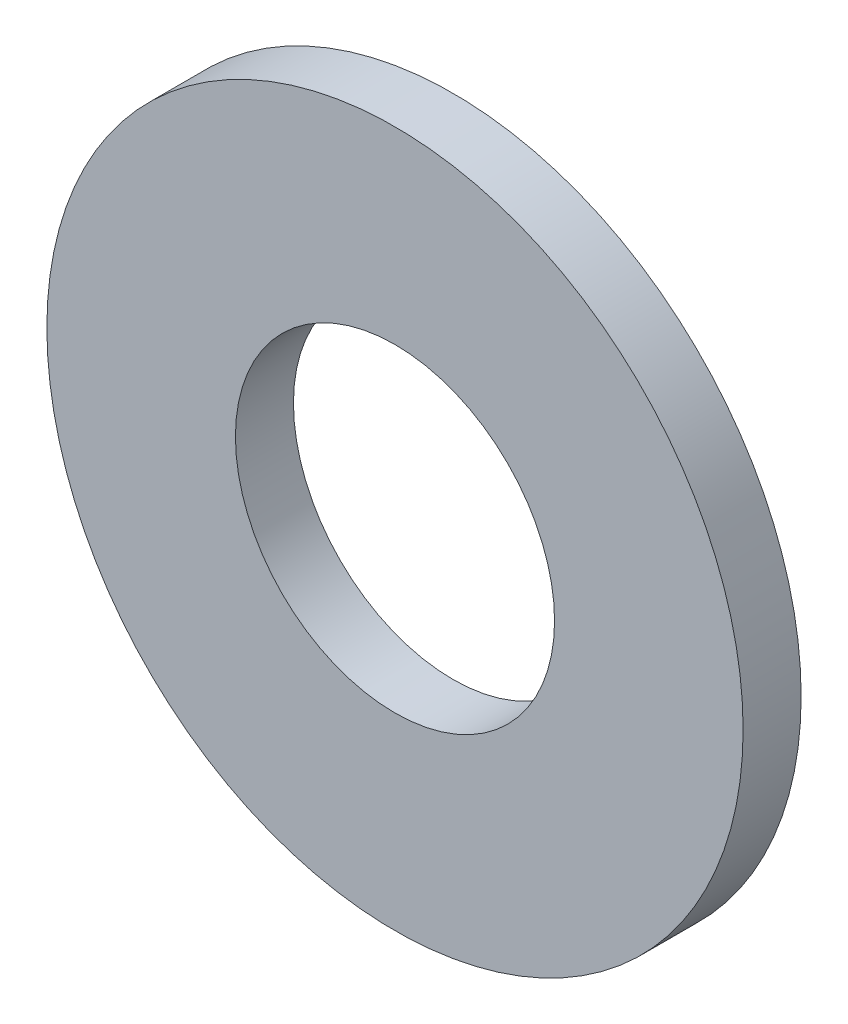
ISO-10303-21;
HEADER;
FILE_DESCRIPTION(('STEP AP214'),'2;1');
FILE_NAME('part.step','',(''),(''),'','','');
FILE_SCHEMA(('AUTOMOTIVE_DESIGN { 1 0 10303 214 1 1 1 1 }'));
ENDSEC;
DATA;
#1=APPLICATION_CONTEXT('core data for automotive mechanical design processes');
#2=APPLICATION_PROTOCOL_DEFINITION('international standard','automotive_design',2000,#1);
#3=PRODUCT_CONTEXT('',#1,'mechanical');
#4=PRODUCT('Part','Part','',(#3));
#5=PRODUCT_RELATED_PRODUCT_CATEGORY('part','',(#4));
#6=PRODUCT_DEFINITION_FORMATION('','',#4);
#7=PRODUCT_DEFINITION_CONTEXT('part definition',#1,'design');
#8=PRODUCT_DEFINITION('design','',#6,#7);
#9=PRODUCT_DEFINITION_SHAPE('','',#8);
#10=(LENGTH_UNIT() NAMED_UNIT(*) SI_UNIT(.MILLI.,.METRE.));
#11=(NAMED_UNIT(*) PLANE_ANGLE_UNIT() SI_UNIT($,.RADIAN.));
#12=(NAMED_UNIT(*) SI_UNIT($,.STERADIAN.) SOLID_ANGLE_UNIT());
#13=UNCERTAINTY_MEASURE_WITH_UNIT(LENGTH_MEASURE(1.E-05),#10,'distance_accuracy_value','');
#14=(GEOMETRIC_REPRESENTATION_CONTEXT(3) GLOBAL_UNCERTAINTY_ASSIGNED_CONTEXT((#13)) GLOBAL_UNIT_ASSIGNED_CONTEXT((#10,
#11,#12)) REPRESENTATION_CONTEXT('',''));
#15=CARTESIAN_POINT('',(0.,0.,0.));
#16=DIRECTION('',(0.,0.,1.));
#17=DIRECTION('',(1.,0.,0.));
#18=AXIS2_PLACEMENT_3D('',#15,#16,#17);
#19=CARTESIAN_POINT('',(0.,0.,1.));
#20=DIRECTION('',(0.,0.,1.));
#21=DIRECTION('',(1.,0.,0.));
#22=AXIS2_PLACEMENT_3D('',#19,#20,#21);
#23=PLANE('',#22);
#24=CARTESIAN_POINT('',(0.,0.,1.));
#25=DIRECTION('',(0.,0.,1.));
#26=DIRECTION('',(1.,0.,0.));
#27=AXIS2_PLACEMENT_3D('',#24,#25,#26);
#28=CIRCLE('',#27,6.);
#29=CARTESIAN_POINT('',(6.,0.,1.));
#30=VERTEX_POINT('',#29);
#31=EDGE_CURVE('E10',#30,#30,#28,.T.);
#32=ORIENTED_EDGE('',*,*,#31,.T.);
#33=EDGE_LOOP('',(#32));
#34=FACE_BOUND('',#33,.T.);
#35=CARTESIAN_POINT('',(0.,0.,1.));
#36=DIRECTION('',(0.,0.,1.));
#37=DIRECTION('',(1.,0.,0.));
#38=AXIS2_PLACEMENT_3D('',#35,#36,#37);
#39=CIRCLE('',#38,2.75);
#40=CARTESIAN_POINT('',(2.75,0.,1.));
#41=VERTEX_POINT('',#40);
#42=EDGE_CURVE('E46',#41,#41,#39,.T.);
#43=ORIENTED_EDGE('',*,*,#42,.F.);
#44=EDGE_LOOP('',(#43));
#45=FACE_BOUND('',#44,.T.);
#46=ADVANCED_FACE('F33',(#34,#45),#23,.T.);
#47=CARTESIAN_POINT('',(0.,0.,0.));
#48=DIRECTION('',(0.,0.,1.));
#49=DIRECTION('',(1.,0.,0.));
#50=AXIS2_PLACEMENT_3D('',#47,#48,#49);
#51=PLANE('',#50);
#52=CARTESIAN_POINT('',(0.,0.,0.));
#53=DIRECTION('',(0.,0.,1.));
#54=DIRECTION('',(1.,0.,0.));
#55=AXIS2_PLACEMENT_3D('',#52,#53,#54);
#56=CIRCLE('',#55,6.);
#57=CARTESIAN_POINT('',(6.,0.,0.));
#58=VERTEX_POINT('',#57);
#59=EDGE_CURVE('E37',#58,#58,#56,.T.);
#60=ORIENTED_EDGE('',*,*,#59,.F.);
#61=EDGE_LOOP('',(#60));
#62=FACE_BOUND('',#61,.T.);
#63=CARTESIAN_POINT('',(0.,0.,0.));
#64=DIRECTION('',(0.,0.,1.));
#65=DIRECTION('',(1.,0.,0.));
#66=AXIS2_PLACEMENT_3D('',#63,#64,#65);
#67=CIRCLE('',#66,2.75);
#68=CARTESIAN_POINT('',(2.75,0.,0.));
#69=VERTEX_POINT('',#68);
#70=EDGE_CURVE('E48',#69,#69,#67,.T.);
#71=ORIENTED_EDGE('',*,*,#70,.T.);
#72=EDGE_LOOP('',(#71));
#73=FACE_BOUND('',#72,.T.);
#74=ADVANCED_FACE('F58',(#62,#73),#51,.F.);
#75=CARTESIAN_POINT('',(0.,0.,1.));
#76=DIRECTION('',(0.,0.,-1.));
#77=DIRECTION('',(-1.,0.,0.));
#78=AXIS2_PLACEMENT_3D('',#75,#76,#77);
#79=CYLINDRICAL_SURFACE('',#78,6.);
#80=ORIENTED_EDGE('',*,*,#31,.F.);
#81=EDGE_LOOP('',(#80));
#82=FACE_BOUND('',#81,.T.);
#83=ORIENTED_EDGE('',*,*,#59,.T.);
#84=EDGE_LOOP('',(#83));
#85=FACE_BOUND('',#84,.T.);
#86=ADVANCED_FACE('F35',(#82,#85),#79,.T.);
#87=CARTESIAN_POINT('',(0.,0.,1.));
#88=DIRECTION('',(0.,0.,-1.));
#89=DIRECTION('',(-1.,0.,0.));
#90=AXIS2_PLACEMENT_3D('',#87,#88,#89);
#91=CYLINDRICAL_SURFACE('',#90,2.75);
#92=ORIENTED_EDGE('',*,*,#42,.T.);
#93=EDGE_LOOP('',(#92));
#94=FACE_BOUND('',#93,.T.);
#95=ORIENTED_EDGE('',*,*,#70,.F.);
#96=EDGE_LOOP('',(#95));
#97=FACE_BOUND('',#96,.T.);
#98=ADVANCED_FACE('F54',(#94,#97),#91,.F.);
#99=CLOSED_SHELL('',(#46,#74,#86,#98));
#100=MANIFOLD_SOLID_BREP('B2',#99);
#101=ADVANCED_BREP_SHAPE_REPRESENTATION('',(#18,#100),#14);
#102=SHAPE_DEFINITION_REPRESENTATION(#9,#101);
ENDSEC;
END-ISO-10303-21;
